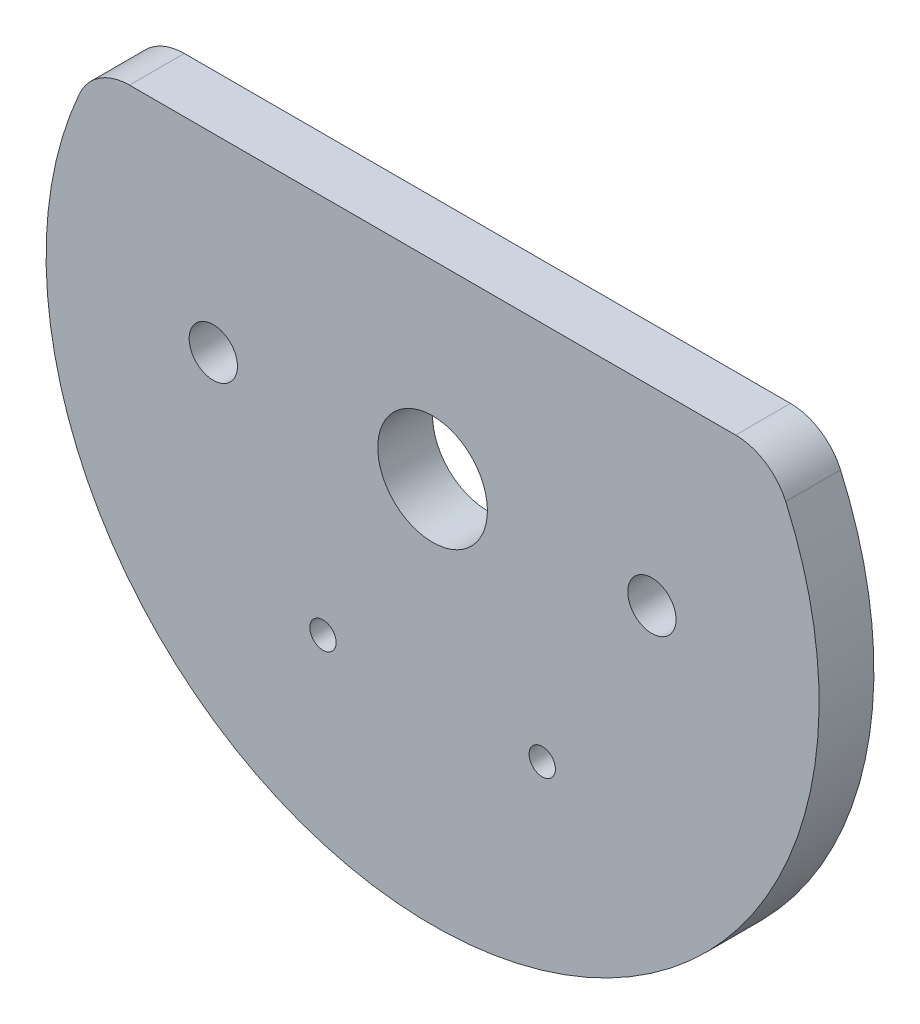
ISO-10303-21;
HEADER;
FILE_DESCRIPTION(('STEP AP214'),'2;1');
FILE_NAME('part.step','',(''),(''),'','','');
FILE_SCHEMA(('AUTOMOTIVE_DESIGN { 1 0 10303 214 1 1 1 1 }'));
ENDSEC;
DATA;
#1=APPLICATION_CONTEXT('core data for automotive mechanical design processes');
#2=APPLICATION_PROTOCOL_DEFINITION('international standard','automotive_design',2000,#1);
#3=PRODUCT_CONTEXT('',#1,'mechanical');
#4=PRODUCT('Part','Part','',(#3));
#5=PRODUCT_RELATED_PRODUCT_CATEGORY('part','',(#4));
#6=PRODUCT_DEFINITION_FORMATION('','',#4);
#7=PRODUCT_DEFINITION_CONTEXT('part definition',#1,'design');
#8=PRODUCT_DEFINITION('design','',#6,#7);
#9=PRODUCT_DEFINITION_SHAPE('','',#8);
#10=(LENGTH_UNIT() NAMED_UNIT(*) SI_UNIT(.MILLI.,.METRE.));
#11=(NAMED_UNIT(*) PLANE_ANGLE_UNIT() SI_UNIT($,.RADIAN.));
#12=(NAMED_UNIT(*) SI_UNIT($,.STERADIAN.) SOLID_ANGLE_UNIT());
#13=UNCERTAINTY_MEASURE_WITH_UNIT(LENGTH_MEASURE(1.E-05),#10,'distance_accuracy_value','');
#14=(GEOMETRIC_REPRESENTATION_CONTEXT(3) GLOBAL_UNCERTAINTY_ASSIGNED_CONTEXT((#13)) GLOBAL_UNIT_ASSIGNED_CONTEXT((#10,
#11,#12)) REPRESENTATION_CONTEXT('',''));
#15=CARTESIAN_POINT('',(0.,0.,0.));
#16=DIRECTION('',(0.,0.,1.));
#17=DIRECTION('',(1.,0.,0.));
#18=AXIS2_PLACEMENT_3D('',#15,#16,#17);
#19=CARTESIAN_POINT('',(69.0541023726342,-28.6031457402453,-3.175));
#20=DIRECTION('',(0.,0.,1.));
#21=DIRECTION('',(-1.,0.,0.));
#22=AXIS2_PLACEMENT_3D('',#19,#20,#21);
#23=CYLINDRICAL_SURFACE('',#22,22.38375);
#24=CARTESIAN_POINT('',(69.0541023726342,-28.6031457402453,0.));
#25=DIRECTION('',(0.,0.,1.));
#26=DIRECTION('',(1.,0.,0.));
#27=AXIS2_PLACEMENT_3D('',#24,#25,#26);
#28=CIRCLE('',#27,22.38375);
#29=CARTESIAN_POINT('',(48.6023586338379,-19.5059790326871,0.));
#30=VERTEX_POINT('',#29);
#31=CARTESIAN_POINT('',(89.5058461114306,-19.5059790326871,0.));
#32=VERTEX_POINT('',#31);
#33=EDGE_CURVE('E35',#30,#32,#28,.T.);
#34=ORIENTED_EDGE('',*,*,#33,.F.);
#35=DIRECTION('',(0.,0.,1.));
#36=VECTOR('',#35,1.);
#37=CARTESIAN_POINT('',(48.6023586338379,-19.5059790326872,-1.5875));
#38=LINE('',#37,#36);
#39=CARTESIAN_POINT('',(48.6023586338379,-19.5059790326872,-3.175));
#40=VERTEX_POINT('',#39);
#41=EDGE_CURVE('E118',#30,#40,#38,.F.);
#42=ORIENTED_EDGE('',*,*,#41,.T.);
#43=CARTESIAN_POINT('',(69.0541023726342,-28.6031457402453,-3.175));
#44=DIRECTION('',(0.,0.,1.));
#45=DIRECTION('',(1.,0.,0.));
#46=AXIS2_PLACEMENT_3D('',#43,#44,#45);
#47=CIRCLE('',#46,22.38375);
#48=CARTESIAN_POINT('',(89.5058461114306,-19.5059790326871,-3.175));
#49=VERTEX_POINT('',#48);
#50=EDGE_CURVE('E11',#40,#49,#47,.T.);
#51=ORIENTED_EDGE('',*,*,#50,.T.);
#52=DIRECTION('',(0.,0.,1.));
#53=VECTOR('',#52,1.);
#54=CARTESIAN_POINT('',(89.5058461114306,-19.5059790326871,-1.5875));
#55=LINE('',#54,#53);
#56=EDGE_CURVE('E85',#49,#32,#55,.T.);
#57=ORIENTED_EDGE('',*,*,#56,.T.);
#58=EDGE_LOOP('',(#34,#42,#51,#57));
#59=FACE_BOUND('',#58,.T.);
#60=ADVANCED_FACE('F32',(#59),#23,.T.);
#61=CARTESIAN_POINT('',(69.0541023726342,-28.6031457402453,-3.175));
#62=DIRECTION('',(0.,0.,-1.));
#63=DIRECTION('',(1.,0.,0.));
#64=AXIS2_PLACEMENT_3D('',#61,#62,#63);
#65=PLANE('',#64);
#66=CARTESIAN_POINT('',(69.0541023726342,-28.6031457402453,-3.175));
#67=DIRECTION('',(0.,0.,1.));
#68=DIRECTION('',(1.,0.,0.));
#69=AXIS2_PLACEMENT_3D('',#66,#67,#68);
#70=CIRCLE('',#69,3.175);
#71=CARTESIAN_POINT('',(72.2291023726342,-28.6031457402453,-3.175));
#72=VERTEX_POINT('',#71);
#73=EDGE_CURVE('E134',#72,#72,#70,.T.);
#74=ORIENTED_EDGE('',*,*,#73,.T.);
#75=EDGE_LOOP('',(#74));
#76=FACE_BOUND('',#75,.T.);
#77=CARTESIAN_POINT('',(75.4041023726343,-39.6016683683077,-3.175));
#78=DIRECTION('',(0.,0.,1.));
#79=DIRECTION('',(1.,0.,0.));
#80=AXIS2_PLACEMENT_3D('',#77,#78,#79);
#81=CIRCLE('',#80,0.762000000000003);
#82=CARTESIAN_POINT('',(76.1661023726343,-39.6016683683077,-3.175));
#83=VERTEX_POINT('',#82);
#84=EDGE_CURVE('E93',#83,#83,#81,.T.);
#85=ORIENTED_EDGE('',*,*,#84,.T.);
#86=EDGE_LOOP('',(#85));
#87=FACE_BOUND('',#86,.T.);
#88=CARTESIAN_POINT('',(62.7041023726342,-39.6016683683077,-3.175));
#89=DIRECTION('',(0.,0.,1.));
#90=DIRECTION('',(1.,0.,0.));
#91=AXIS2_PLACEMENT_3D('',#88,#89,#90);
#92=CIRCLE('',#91,0.762000000000003);
#93=CARTESIAN_POINT('',(63.4661023726342,-39.6016683683077,-3.175));
#94=VERTEX_POINT('',#93);
#95=EDGE_CURVE('E100',#94,#94,#92,.T.);
#96=ORIENTED_EDGE('',*,*,#95,.T.);
#97=EDGE_LOOP('',(#96));
#98=FACE_BOUND('',#97,.T.);
#99=CARTESIAN_POINT('',(81.7541023726343,-28.6031457402453,-3.175));
#100=DIRECTION('',(0.,0.,1.));
#101=DIRECTION('',(-1.,0.,0.));
#102=AXIS2_PLACEMENT_3D('',#99,#100,#101);
#103=CIRCLE('',#102,1.39699999999999);
#104=CARTESIAN_POINT('',(80.3571023726343,-28.6031457402453,-3.175));
#105=VERTEX_POINT('',#104);
#106=EDGE_CURVE('E106',#105,#105,#103,.T.);
#107=ORIENTED_EDGE('',*,*,#106,.T.);
#108=EDGE_LOOP('',(#107));
#109=FACE_BOUND('',#108,.T.);
#110=CARTESIAN_POINT('',(56.3541023726342,-28.6031457402453,-3.175));
#111=DIRECTION('',(0.,0.,1.));
#112=DIRECTION('',(1.,0.,0.));
#113=AXIS2_PLACEMENT_3D('',#110,#111,#112);
#114=CIRCLE('',#113,1.39700000000001);
#115=CARTESIAN_POINT('',(57.7511023726343,-28.6031457402453,-3.175));
#116=VERTEX_POINT('',#115);
#117=EDGE_CURVE('E112',#116,#116,#114,.T.);
#118=ORIENTED_EDGE('',*,*,#117,.T.);
#119=EDGE_LOOP('',(#118));
#120=FACE_BOUND('',#119,.T.);
#121=ORIENTED_EDGE('',*,*,#50,.F.);
#122=CARTESIAN_POINT('',(51.5033151925324,-20.7963572890784,-3.175));
#123=DIRECTION('',(0.,0.,1.));
#124=DIRECTION('',(-1.,0.,0.));
#125=AXIS2_PLACEMENT_3D('',#122,#123,#124);
#126=CIRCLE('',#125,3.175);
#127=CARTESIAN_POINT('',(51.5033151925324,-17.6213572890784,-3.175));
#128=VERTEX_POINT('',#127);
#129=EDGE_CURVE('E54',#128,#40,#126,.T.);
#130=ORIENTED_EDGE('',*,*,#129,.F.);
#131=DIRECTION('',(-1.,0.,0.));
#132=VECTOR('',#131,1.);
#133=CARTESIAN_POINT('',(51.5033151925324,-17.6213572890784,-3.175));
#134=LINE('',#133,#132);
#135=CARTESIAN_POINT('',(86.6048895527361,-17.6213572890784,-3.175));
#136=VERTEX_POINT('',#135);
#137=EDGE_CURVE('E78',#136,#128,#134,.T.);
#138=ORIENTED_EDGE('',*,*,#137,.F.);
#139=CARTESIAN_POINT('',(86.6048895527361,-20.7963572890784,-3.175));
#140=DIRECTION('',(0.,0.,1.));
#141=DIRECTION('',(1.,0.,0.));
#142=AXIS2_PLACEMENT_3D('',#139,#140,#141);
#143=CIRCLE('',#142,3.17500000000001);
#144=EDGE_CURVE('E83',#49,#136,#143,.T.);
#145=ORIENTED_EDGE('',*,*,#144,.F.);
#146=EDGE_LOOP('',(#121,#130,#138,#145));
#147=FACE_BOUND('',#146,.T.);
#148=ADVANCED_FACE('F88',(#76,#87,#98,#109,#120,#147),#65,.T.);
#149=CARTESIAN_POINT('',(69.0541023726342,-28.6031457402453,0.));
#150=DIRECTION('',(0.,0.,-1.));
#151=DIRECTION('',(1.,0.,0.));
#152=AXIS2_PLACEMENT_3D('',#149,#150,#151);
#153=PLANE('',#152);
#154=CARTESIAN_POINT('',(69.0541023726342,-28.6031457402453,0.));
#155=DIRECTION('',(0.,0.,1.));
#156=DIRECTION('',(1.,0.,0.));
#157=AXIS2_PLACEMENT_3D('',#154,#155,#156);
#158=CIRCLE('',#157,3.175);
#159=CARTESIAN_POINT('',(72.2291023726342,-28.6031457402453,0.));
#160=VERTEX_POINT('',#159);
#161=EDGE_CURVE('E132',#160,#160,#158,.F.);
#162=ORIENTED_EDGE('',*,*,#161,.T.);
#163=EDGE_LOOP('',(#162));
#164=FACE_BOUND('',#163,.T.);
#165=CARTESIAN_POINT('',(75.4041023726343,-39.6016683683077,0.));
#166=DIRECTION('',(0.,0.,1.));
#167=DIRECTION('',(1.,0.,0.));
#168=AXIS2_PLACEMENT_3D('',#165,#166,#167);
#169=CIRCLE('',#168,0.762000000000003);
#170=CARTESIAN_POINT('',(76.1661023726343,-39.6016683683077,0.));
#171=VERTEX_POINT('',#170);
#172=EDGE_CURVE('E96',#171,#171,#169,.F.);
#173=ORIENTED_EDGE('',*,*,#172,.T.);
#174=EDGE_LOOP('',(#173));
#175=FACE_BOUND('',#174,.T.);
#176=CARTESIAN_POINT('',(62.7041023726342,-39.6016683683077,0.));
#177=DIRECTION('',(0.,0.,1.));
#178=DIRECTION('',(1.,0.,0.));
#179=AXIS2_PLACEMENT_3D('',#176,#177,#178);
#180=CIRCLE('',#179,0.762000000000003);
#181=CARTESIAN_POINT('',(63.4661023726342,-39.6016683683077,0.));
#182=VERTEX_POINT('',#181);
#183=EDGE_CURVE('E103',#182,#182,#180,.F.);
#184=ORIENTED_EDGE('',*,*,#183,.T.);
#185=EDGE_LOOP('',(#184));
#186=FACE_BOUND('',#185,.T.);
#187=CARTESIAN_POINT('',(81.7541023726343,-28.6031457402453,0.));
#188=DIRECTION('',(0.,0.,1.));
#189=DIRECTION('',(1.,0.,0.));
#190=AXIS2_PLACEMENT_3D('',#187,#188,#189);
#191=CIRCLE('',#190,1.39699999999999);
#192=CARTESIAN_POINT('',(83.1511023726342,-28.6031457402453,0.));
#193=VERTEX_POINT('',#192);
#194=EDGE_CURVE('E109',#193,#193,#191,.F.);
#195=ORIENTED_EDGE('',*,*,#194,.T.);
#196=EDGE_LOOP('',(#195));
#197=FACE_BOUND('',#196,.T.);
#198=CARTESIAN_POINT('',(56.3541023726342,-28.6031457402453,0.));
#199=DIRECTION('',(0.,0.,1.));
#200=DIRECTION('',(1.,0.,0.));
#201=AXIS2_PLACEMENT_3D('',#198,#199,#200);
#202=CIRCLE('',#201,1.39700000000001);
#203=CARTESIAN_POINT('',(57.7511023726343,-28.6031457402453,0.));
#204=VERTEX_POINT('',#203);
#205=EDGE_CURVE('E115',#204,#204,#202,.F.);
#206=ORIENTED_EDGE('',*,*,#205,.T.);
#207=EDGE_LOOP('',(#206));
#208=FACE_BOUND('',#207,.T.);
#209=ORIENTED_EDGE('',*,*,#33,.T.);
#210=CARTESIAN_POINT('',(86.6048895527361,-20.7963572890784,0.));
#211=DIRECTION('',(0.,0.,1.));
#212=DIRECTION('',(1.,0.,0.));
#213=AXIS2_PLACEMENT_3D('',#210,#211,#212);
#214=CIRCLE('',#213,3.17500000000001);
#215=CARTESIAN_POINT('',(86.6048895527361,-17.6213572890784,0.));
#216=VERTEX_POINT('',#215);
#217=EDGE_CURVE('E46',#216,#32,#214,.F.);
#218=ORIENTED_EDGE('',*,*,#217,.F.);
#219=DIRECTION('',(1.,0.,0.));
#220=VECTOR('',#219,1.);
#221=CARTESIAN_POINT('',(51.5033151925324,-17.6213572890784,0.));
#222=LINE('',#221,#220);
#223=CARTESIAN_POINT('',(51.5033151925324,-17.6213572890784,0.));
#224=VERTEX_POINT('',#223);
#225=EDGE_CURVE('E80',#224,#216,#222,.T.);
#226=ORIENTED_EDGE('',*,*,#225,.F.);
#227=CARTESIAN_POINT('',(51.5033151925324,-20.7963572890784,0.));
#228=DIRECTION('',(0.,0.,1.));
#229=DIRECTION('',(1.,0.,0.));
#230=AXIS2_PLACEMENT_3D('',#227,#228,#229);
#231=CIRCLE('',#230,3.175);
#232=EDGE_CURVE('E97',#30,#224,#231,.F.);
#233=ORIENTED_EDGE('',*,*,#232,.F.);
#234=EDGE_LOOP('',(#209,#218,#226,#233));
#235=FACE_BOUND('',#234,.T.);
#236=ADVANCED_FACE('F125',(#164,#175,#186,#197,#208,#235),#153,.F.);
#237=CARTESIAN_POINT('',(56.3541023726342,-28.6031457402453,0.00100000000000013));
#238=DIRECTION('',(0.,0.,-1.));
#239=DIRECTION('',(1.,0.,0.));
#240=AXIS2_PLACEMENT_3D('',#237,#238,#239);
#241=CYLINDRICAL_SURFACE('',#240,1.39700000000001);
#242=ORIENTED_EDGE('',*,*,#117,.F.);
#243=EDGE_LOOP('',(#242));
#244=FACE_BOUND('',#243,.T.);
#245=ORIENTED_EDGE('',*,*,#205,.F.);
#246=EDGE_LOOP('',(#245));
#247=FACE_BOUND('',#246,.T.);
#248=ADVANCED_FACE('F160',(#244,#247),#241,.F.);
#249=CARTESIAN_POINT('',(81.7541023726343,-28.6031457402453,0.00100000000000013));
#250=DIRECTION('',(0.,0.,-1.));
#251=DIRECTION('',(1.,0.,0.));
#252=AXIS2_PLACEMENT_3D('',#249,#250,#251);
#253=CYLINDRICAL_SURFACE('',#252,1.39699999999999);
#254=ORIENTED_EDGE('',*,*,#106,.F.);
#255=EDGE_LOOP('',(#254));
#256=FACE_BOUND('',#255,.T.);
#257=ORIENTED_EDGE('',*,*,#194,.F.);
#258=EDGE_LOOP('',(#257));
#259=FACE_BOUND('',#258,.T.);
#260=ADVANCED_FACE('F164',(#256,#259),#253,.F.);
#261=CARTESIAN_POINT('',(62.7041023726342,-39.6016683683077,0.00100000000000013));
#262=DIRECTION('',(0.,0.,-1.));
#263=DIRECTION('',(1.,0.,0.));
#264=AXIS2_PLACEMENT_3D('',#261,#262,#263);
#265=CYLINDRICAL_SURFACE('',#264,0.762000000000003);
#266=ORIENTED_EDGE('',*,*,#95,.F.);
#267=EDGE_LOOP('',(#266));
#268=FACE_BOUND('',#267,.T.);
#269=ORIENTED_EDGE('',*,*,#183,.F.);
#270=EDGE_LOOP('',(#269));
#271=FACE_BOUND('',#270,.T.);
#272=ADVANCED_FACE('F168',(#268,#271),#265,.F.);
#273=CARTESIAN_POINT('',(75.4041023726343,-39.6016683683077,0.00100000000000013));
#274=DIRECTION('',(0.,0.,-1.));
#275=DIRECTION('',(1.,0.,0.));
#276=AXIS2_PLACEMENT_3D('',#273,#274,#275);
#277=CYLINDRICAL_SURFACE('',#276,0.762000000000003);
#278=ORIENTED_EDGE('',*,*,#84,.F.);
#279=EDGE_LOOP('',(#278));
#280=FACE_BOUND('',#279,.T.);
#281=ORIENTED_EDGE('',*,*,#172,.F.);
#282=EDGE_LOOP('',(#281));
#283=FACE_BOUND('',#282,.T.);
#284=ADVANCED_FACE('F172',(#280,#283),#277,.F.);
#285=CARTESIAN_POINT('',(51.5033151925324,-20.7963572890784,41.6500884203599));
#286=DIRECTION('',(0.,0.,-1.));
#287=DIRECTION('',(1.,0.,0.));
#288=AXIS2_PLACEMENT_3D('',#285,#286,#287);
#289=CYLINDRICAL_SURFACE('',#288,3.175);
#290=ORIENTED_EDGE('',*,*,#232,.T.);
#291=DIRECTION('',(0.,0.,-1.));
#292=VECTOR('',#291,1.);
#293=CARTESIAN_POINT('',(51.5033151925324,-17.6213572890784,41.6500884203599));
#294=LINE('',#293,#292);
#295=EDGE_CURVE('E81',#224,#128,#294,.T.);
#296=ORIENTED_EDGE('',*,*,#295,.T.);
#297=ORIENTED_EDGE('',*,*,#129,.T.);
#298=ORIENTED_EDGE('',*,*,#41,.F.);
#299=EDGE_LOOP('',(#290,#296,#297,#298));
#300=FACE_BOUND('',#299,.T.);
#301=ADVANCED_FACE('F127',(#300),#289,.T.);
#302=CARTESIAN_POINT('',(51.5033151925324,-17.6213572890784,41.6500884203599));
#303=DIRECTION('',(0.,1.,0.));
#304=DIRECTION('',(0.,0.,-1.));
#305=AXIS2_PLACEMENT_3D('',#302,#303,#304);
#306=PLANE('',#305);
#307=ORIENTED_EDGE('',*,*,#225,.T.);
#308=DIRECTION('',(0.,0.,-1.));
#309=VECTOR('',#308,1.);
#310=CARTESIAN_POINT('',(86.6048895527361,-17.6213572890784,41.6500884203599));
#311=LINE('',#310,#309);
#312=EDGE_CURVE('E74',#216,#136,#311,.T.);
#313=ORIENTED_EDGE('',*,*,#312,.T.);
#314=ORIENTED_EDGE('',*,*,#137,.T.);
#315=ORIENTED_EDGE('',*,*,#295,.F.);
#316=EDGE_LOOP('',(#307,#313,#314,#315));
#317=FACE_BOUND('',#316,.T.);
#318=ADVANCED_FACE('F76',(#317),#306,.T.);
#319=CARTESIAN_POINT('',(86.6048895527361,-20.7963572890784,41.6500884203599));
#320=DIRECTION('',(0.,0.,-1.));
#321=DIRECTION('',(1.,0.,0.));
#322=AXIS2_PLACEMENT_3D('',#319,#320,#321);
#323=CYLINDRICAL_SURFACE('',#322,3.17500000000001);
#324=ORIENTED_EDGE('',*,*,#217,.T.);
#325=ORIENTED_EDGE('',*,*,#56,.F.);
#326=ORIENTED_EDGE('',*,*,#144,.T.);
#327=ORIENTED_EDGE('',*,*,#312,.F.);
#328=EDGE_LOOP('',(#324,#325,#326,#327));
#329=FACE_BOUND('',#328,.T.);
#330=ADVANCED_FACE('F84',(#329),#323,.T.);
#331=CARTESIAN_POINT('',(69.0541023726342,-28.6031457402453,0.00100000000000013));
#332=DIRECTION('',(0.,0.,-1.));
#333=DIRECTION('',(1.,0.,0.));
#334=AXIS2_PLACEMENT_3D('',#331,#332,#333);
#335=CYLINDRICAL_SURFACE('',#334,3.175);
#336=ORIENTED_EDGE('',*,*,#73,.F.);
#337=EDGE_LOOP('',(#336));
#338=FACE_BOUND('',#337,.T.);
#339=ORIENTED_EDGE('',*,*,#161,.F.);
#340=EDGE_LOOP('',(#339));
#341=FACE_BOUND('',#340,.T.);
#342=ADVANCED_FACE('F143',(#338,#341),#335,.F.);
#343=CLOSED_SHELL('',(#60,#148,#236,#248,#260,#272,#284,#301,#318,#330,#342));
#344=MANIFOLD_SOLID_BREP('B2',#343);
#345=ADVANCED_BREP_SHAPE_REPRESENTATION('',(#18,#344),#14);
#346=SHAPE_DEFINITION_REPRESENTATION(#9,#345);
ENDSEC;
END-ISO-10303-21;
